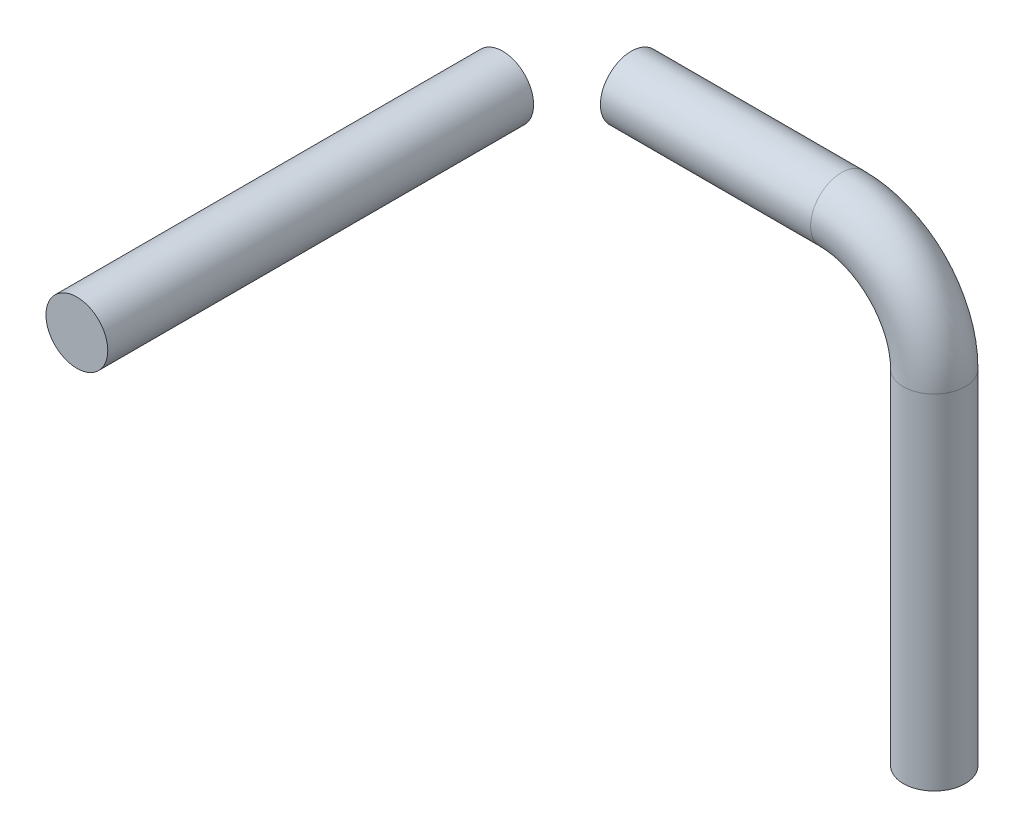
ISO-10303-21;
HEADER;
FILE_DESCRIPTION(('STEP AP214'),'2;1');
FILE_NAME('part.step','',(''),(''),'','','');
FILE_SCHEMA(('AUTOMOTIVE_DESIGN { 1 0 10303 214 1 1 1 1 }'));
ENDSEC;
DATA;
#1=APPLICATION_CONTEXT('core data for automotive mechanical design processes');
#2=APPLICATION_PROTOCOL_DEFINITION('international standard','automotive_design',2000,#1);
#3=PRODUCT_CONTEXT('',#1,'mechanical');
#4=PRODUCT('Part','Part','',(#3));
#5=PRODUCT_RELATED_PRODUCT_CATEGORY('part','',(#4));
#6=PRODUCT_DEFINITION_FORMATION('','',#4);
#7=PRODUCT_DEFINITION_CONTEXT('part definition',#1,'design');
#8=PRODUCT_DEFINITION('design','',#6,#7);
#9=PRODUCT_DEFINITION_SHAPE('','',#8);
#10=(LENGTH_UNIT() NAMED_UNIT(*) SI_UNIT(.MILLI.,.METRE.));
#11=(NAMED_UNIT(*) PLANE_ANGLE_UNIT() SI_UNIT($,.RADIAN.));
#12=(NAMED_UNIT(*) SI_UNIT($,.STERADIAN.) SOLID_ANGLE_UNIT());
#13=UNCERTAINTY_MEASURE_WITH_UNIT(LENGTH_MEASURE(1.E-05),#10,'distance_accuracy_value','');
#14=(GEOMETRIC_REPRESENTATION_CONTEXT(3) GLOBAL_UNCERTAINTY_ASSIGNED_CONTEXT((#13)) GLOBAL_UNIT_ASSIGNED_CONTEXT((#10,
#11,#12)) REPRESENTATION_CONTEXT('',''));
#15=CARTESIAN_POINT('',(0.,0.,0.));
#16=DIRECTION('',(0.,0.,1.));
#17=DIRECTION('',(1.,0.,0.));
#18=AXIS2_PLACEMENT_3D('',#15,#16,#17);
#19=CARTESIAN_POINT('',(0.,0.,-84.0740000000007));
#20=DIRECTION('',(0.,0.,1.));
#21=DIRECTION('',(-1.,0.,0.));
#22=AXIS2_PLACEMENT_3D('',#19,#20,#21);
#23=PLANE('',#22);
#24=CARTESIAN_POINT('',(0.,0.,-84.0740000000007));
#25=DIRECTION('',(0.,0.,-1.));
#26=DIRECTION('',(-1.,0.,0.));
#27=AXIS2_PLACEMENT_3D('',#24,#25,#26);
#28=CIRCLE('',#27,6.35);
#29=CARTESIAN_POINT('',(-6.35,0.,-84.0740000000007));
#30=VERTEX_POINT('',#29);
#31=EDGE_CURVE('E48',#30,#30,#28,.T.);
#32=ORIENTED_EDGE('',*,*,#31,.T.);
#33=EDGE_LOOP('',(#32));
#34=FACE_BOUND('',#33,.T.);
#35=ADVANCED_FACE('F41',(#34),#23,.F.);
#36=CARTESIAN_POINT('',(0.,0.,21.3387122421383));
#37=DIRECTION('',(0.,0.,-1.));
#38=DIRECTION('',(1.,0.,0.));
#39=AXIS2_PLACEMENT_3D('',#36,#37,#38);
#40=CYLINDRICAL_SURFACE('',#39,6.35);
#41=CARTESIAN_POINT('',(0.,0.,3.37819999999999));
#42=DIRECTION('',(0.,0.,1.));
#43=DIRECTION('',(1.,0.,0.));
#44=AXIS2_PLACEMENT_3D('',#41,#42,#43);
#45=CIRCLE('',#44,6.35);
#46=CARTESIAN_POINT('',(6.35,0.,3.37819999999999));
#47=VERTEX_POINT('',#46);
#48=EDGE_CURVE('E11',#47,#47,#45,.T.);
#49=ORIENTED_EDGE('',*,*,#48,.F.);
#50=EDGE_LOOP('',(#49));
#51=FACE_BOUND('',#50,.T.);
#52=ORIENTED_EDGE('',*,*,#31,.F.);
#53=EDGE_LOOP('',(#52));
#54=FACE_BOUND('',#53,.T.);
#55=ADVANCED_FACE('F43',(#51,#54),#40,.T.);
#56=CARTESIAN_POINT('',(0.,0.,3.37819999999999));
#57=DIRECTION('',(0.,0.,-1.));
#58=DIRECTION('',(1.,0.,0.));
#59=AXIS2_PLACEMENT_3D('',#56,#57,#58);
#60=PLANE('',#59);
#61=ORIENTED_EDGE('',*,*,#48,.T.);
#62=EDGE_LOOP('',(#61));
#63=FACE_BOUND('',#62,.T.);
#64=ADVANCED_FACE('F56',(#63),#60,.F.);
#65=CLOSED_SHELL('',(#35,#55,#64));
#66=MANIFOLD_SOLID_BREP('B2',#65);
#67=CARTESIAN_POINT('',(56.3814706539702,-3.60822483003176E-13,-97.2819999985061));
#68=DIRECTION('',(-1.,0.,0.));
#69=DIRECTION('',(0.,-1.,0.));
#70=AXIS2_PLACEMENT_3D('',#67,#68,#69);
#71=CYLINDRICAL_SURFACE('',#70,6.34999999999999);
#72=CARTESIAN_POINT('',(56.3814706539702,-3.60822483003176E-13,-97.2819999985061));
#73=DIRECTION('',(-1.,0.,0.));
#74=DIRECTION('',(0.,0.,1.));
#75=AXIS2_PLACEMENT_3D('',#72,#73,#74);
#76=CIRCLE('',#75,6.34999999999999);
#77=CARTESIAN_POINT('',(56.3814706539702,6.34999999999963,-97.2819999985061));
#78=VERTEX_POINT('',#77);
#79=EDGE_CURVE('E88',#78,#78,#76,.T.);
#80=ORIENTED_EDGE('',*,*,#79,.T.);
#81=EDGE_LOOP('',(#80));
#82=FACE_BOUND('',#81,.T.);
#83=CARTESIAN_POINT('',(13.2080000000033,9.34153308865755E-13,-97.2819999985061));
#84=DIRECTION('',(-1.,0.,0.));
#85=DIRECTION('',(0.,0.,1.));
#86=AXIS2_PLACEMENT_3D('',#83,#84,#85);
#87=CIRCLE('',#86,6.34999999999999);
#88=CARTESIAN_POINT('',(13.2080000000033,9.34153308865755E-13,-90.9319999985061));
#89=VERTEX_POINT('',#88);
#90=EDGE_CURVE('E40',#89,#89,#87,.T.);
#91=ORIENTED_EDGE('',*,*,#90,.F.);
#92=EDGE_LOOP('',(#91));
#93=FACE_BOUND('',#92,.T.);
#94=ADVANCED_FACE('F82',(#82,#93),#71,.T.);
#95=CARTESIAN_POINT('',(56.3814706539702,-19.05,-97.2819999985061));
#96=DIRECTION('',(0.,0.,-1.));
#97=DIRECTION('',(1.,0.,0.));
#98=AXIS2_PLACEMENT_3D('',#95,#96,#97);
#99=TOROIDAL_SURFACE('',#98,19.0499999999996,6.34999999999999);
#100=CARTESIAN_POINT('',(75.4314706539698,-19.05,-97.2819999985061));
#101=DIRECTION('',(0.,1.,0.));
#102=DIRECTION('',(0.,0.,1.));
#103=AXIS2_PLACEMENT_3D('',#100,#101,#102);
#104=CIRCLE('',#103,6.34999999999999);
#105=CARTESIAN_POINT('',(81.7814706539698,-19.05,-97.2819999985061));
#106=VERTEX_POINT('',#105);
#107=EDGE_CURVE('E92',#106,#106,#104,.T.);
#108=CARTESIAN_POINT('',(56.3814706539702,-19.05,-97.2819999985061));
#109=DIRECTION('',(0.,0.,-1.));
#110=DIRECTION('',(1.,0.,0.));
#111=AXIS2_PLACEMENT_3D('',#108,#109,#110);
#112=CIRCLE('',#111,25.3999999999996);
#113=EDGE_CURVE('',#78,#106,#112,.T.);
#114=ORIENTED_EDGE('',*,*,#79,.F.);
#115=ORIENTED_EDGE('',*,*,#107,.T.);
#116=ORIENTED_EDGE('',*,*,#113,.T.);
#117=ORIENTED_EDGE('',*,*,#113,.F.);
#118=EDGE_LOOP('',(#114,#116,#115,#117));
#119=FACE_BOUND('',#118,.T.);
#120=ADVANCED_FACE('F114',(#119),#99,.T.);
#121=CARTESIAN_POINT('',(75.4314706539698,-19.05,-97.2819999985061));
#122=DIRECTION('',(0.,-1.,0.));
#123=DIRECTION('',(0.,0.,1.));
#124=AXIS2_PLACEMENT_3D('',#121,#122,#123);
#125=CYLINDRICAL_SURFACE('',#124,6.34999999999999);
#126=ORIENTED_EDGE('',*,*,#107,.F.);
#127=EDGE_LOOP('',(#126));
#128=FACE_BOUND('',#127,.T.);
#129=CARTESIAN_POINT('',(75.4314706539698,-89.6526500374171,-97.2819999985061));
#130=DIRECTION('',(0.,1.,0.));
#131=DIRECTION('',(0.,0.,1.));
#132=AXIS2_PLACEMENT_3D('',#129,#130,#131);
#133=CIRCLE('',#132,6.34999999999999);
#134=CARTESIAN_POINT('',(75.4314706539698,-89.6526500374171,-90.9319999985061));
#135=VERTEX_POINT('',#134);
#136=EDGE_CURVE('E96',#135,#135,#133,.T.);
#137=ORIENTED_EDGE('',*,*,#136,.T.);
#138=EDGE_LOOP('',(#137));
#139=FACE_BOUND('',#138,.T.);
#140=ADVANCED_FACE('F102',(#128,#139),#125,.T.);
#141=CARTESIAN_POINT('',(13.2080000000033,9.34153308865755E-13,-97.2819999985061));
#142=DIRECTION('',(1.,0.,0.));
#143=DIRECTION('',(0.,0.,1.));
#144=AXIS2_PLACEMENT_3D('',#141,#142,#143);
#145=PLANE('',#144);
#146=ORIENTED_EDGE('',*,*,#90,.T.);
#147=EDGE_LOOP('',(#146));
#148=FACE_BOUND('',#147,.T.);
#149=ADVANCED_FACE('F106',(#148),#145,.F.);
#150=CARTESIAN_POINT('',(75.4314706539698,-89.6526500374171,-97.2819999985061));
#151=DIRECTION('',(0.,-1.,0.));
#152=DIRECTION('',(0.,0.,1.));
#153=AXIS2_PLACEMENT_3D('',#150,#151,#152);
#154=PLANE('',#153);
#155=ORIENTED_EDGE('',*,*,#136,.F.);
#156=EDGE_LOOP('',(#155));
#157=FACE_BOUND('',#156,.T.);
#158=ADVANCED_FACE('F104',(#157),#154,.T.);
#159=CLOSED_SHELL('',(#94,#120,#140,#149,#158));
#160=MANIFOLD_SOLID_BREP('B6',#159);
#161=ADVANCED_BREP_SHAPE_REPRESENTATION('',(#18,#66,#160),#14);
#162=SHAPE_DEFINITION_REPRESENTATION(#9,#161);
ENDSEC;
END-ISO-10303-21;
